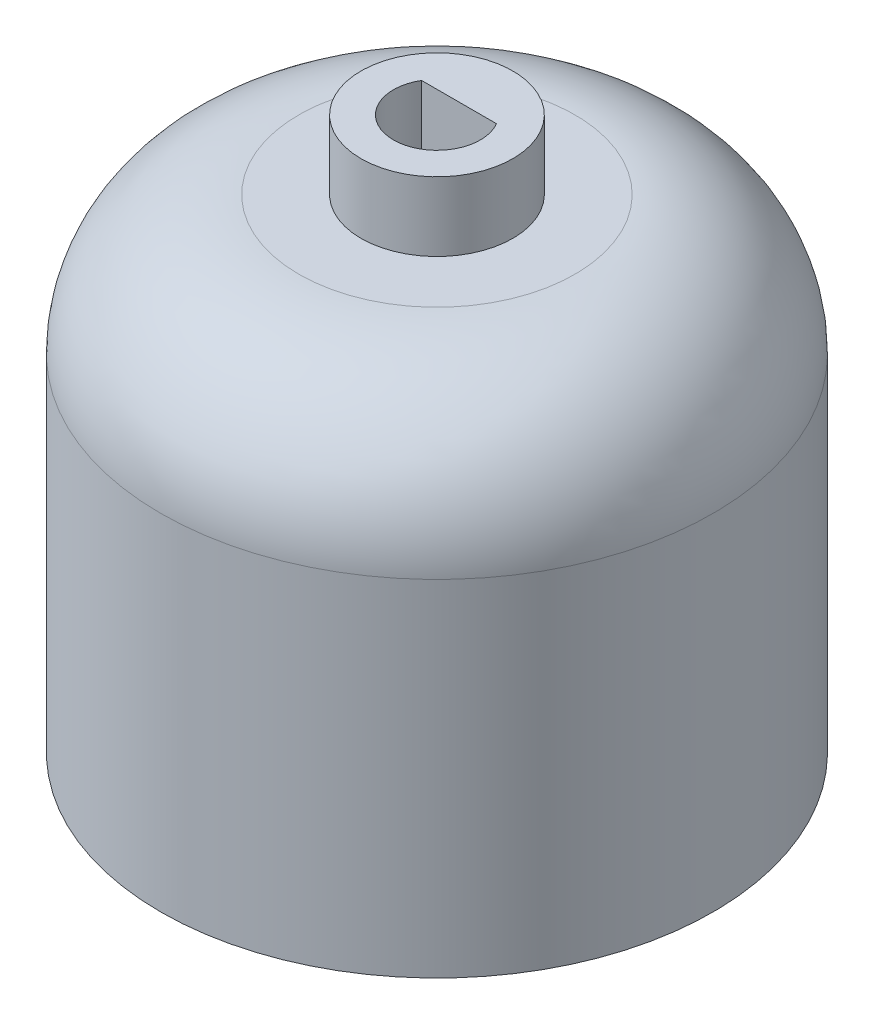
ISO-10303-21;
HEADER;
FILE_DESCRIPTION(('STEP AP214'),'2;1');
FILE_NAME('part.step','',(''),(''),'','','');
FILE_SCHEMA(('AUTOMOTIVE_DESIGN { 1 0 10303 214 1 1 1 1 }'));
ENDSEC;
DATA;
#1=APPLICATION_CONTEXT('core data for automotive mechanical design processes');
#2=APPLICATION_PROTOCOL_DEFINITION('international standard','automotive_design',2000,#1);
#3=PRODUCT_CONTEXT('',#1,'mechanical');
#4=PRODUCT('Part','Part','',(#3));
#5=PRODUCT_RELATED_PRODUCT_CATEGORY('part','',(#4));
#6=PRODUCT_DEFINITION_FORMATION('','',#4);
#7=PRODUCT_DEFINITION_CONTEXT('part definition',#1,'design');
#8=PRODUCT_DEFINITION('design','',#6,#7);
#9=PRODUCT_DEFINITION_SHAPE('','',#8);
#10=(LENGTH_UNIT() NAMED_UNIT(*) SI_UNIT(.MILLI.,.METRE.));
#11=(NAMED_UNIT(*) PLANE_ANGLE_UNIT() SI_UNIT($,.RADIAN.));
#12=(NAMED_UNIT(*) SI_UNIT($,.STERADIAN.) SOLID_ANGLE_UNIT());
#13=UNCERTAINTY_MEASURE_WITH_UNIT(LENGTH_MEASURE(1.E-05),#10,'distance_accuracy_value','');
#14=(GEOMETRIC_REPRESENTATION_CONTEXT(3) GLOBAL_UNCERTAINTY_ASSIGNED_CONTEXT((#13)) GLOBAL_UNIT_ASSIGNED_CONTEXT((#10,
#11,#12)) REPRESENTATION_CONTEXT('',''));
#15=CARTESIAN_POINT('',(0.,0.,0.));
#16=DIRECTION('',(0.,0.,1.));
#17=DIRECTION('',(1.,0.,0.));
#18=AXIS2_PLACEMENT_3D('',#15,#16,#17);
#19=CARTESIAN_POINT('',(0.,35.,0.));
#20=DIRECTION('',(0.,1.,0.));
#21=DIRECTION('',(0.,0.,1.));
#22=AXIS2_PLACEMENT_3D('',#19,#20,#21);
#23=PLANE('',#22);
#24=CARTESIAN_POINT('',(0.,35.,0.));
#25=DIRECTION('',(0.,1.,0.));
#26=DIRECTION('',(0.,0.,1.));
#27=AXIS2_PLACEMENT_3D('',#24,#25,#26);
#28=CIRCLE('',#27,10.);
#29=CARTESIAN_POINT('',(0.,35.,10.));
#30=VERTEX_POINT('',#29);
#31=EDGE_CURVE('E41',#30,#30,#28,.T.);
#32=ORIENTED_EDGE('',*,*,#31,.T.);
#33=EDGE_LOOP('',(#32));
#34=FACE_BOUND('',#33,.T.);
#35=CARTESIAN_POINT('',(0.,35.,0.));
#36=DIRECTION('',(0.,1.,0.));
#37=DIRECTION('',(0.,0.,1.));
#38=AXIS2_PLACEMENT_3D('',#35,#36,#37);
#39=CIRCLE('',#38,5.5);
#40=CARTESIAN_POINT('',(0.,35.,5.5));
#41=VERTEX_POINT('',#40);
#42=EDGE_CURVE('E109',#41,#41,#39,.T.);
#43=ORIENTED_EDGE('',*,*,#42,.F.);
#44=EDGE_LOOP('',(#43));
#45=FACE_BOUND('',#44,.T.);
#46=ADVANCED_FACE('F33',(#34,#45),#23,.T.);
#47=CARTESIAN_POINT('',(0.,0.,0.));
#48=DIRECTION('',(0.,1.,0.));
#49=DIRECTION('',(0.,0.,1.));
#50=AXIS2_PLACEMENT_3D('',#47,#48,#49);
#51=PLANE('',#50);
#52=CARTESIAN_POINT('',(0.,0.,0.));
#53=DIRECTION('',(0.,1.,0.));
#54=DIRECTION('',(0.,0.,1.));
#55=AXIS2_PLACEMENT_3D('',#52,#53,#54);
#56=CIRCLE('',#55,20.);
#57=CARTESIAN_POINT('',(0.,0.,20.));
#58=VERTEX_POINT('',#57);
#59=EDGE_CURVE('E145',#58,#58,#56,.T.);
#60=ORIENTED_EDGE('',*,*,#59,.F.);
#61=EDGE_LOOP('',(#60));
#62=FACE_BOUND('',#61,.T.);
#63=DIRECTION('',(0.,0.,1.));
#64=VECTOR('',#63,1.);
#65=CARTESIAN_POINT('',(-4.4,0.,-17.6));
#66=LINE('',#65,#64);
#67=CARTESIAN_POINT('',(-4.4,0.,-17.6));
#68=VERTEX_POINT('',#67);
#69=CARTESIAN_POINT('',(-4.4,0.,-12.0732141536544));
#70=VERTEX_POINT('',#69);
#71=EDGE_CURVE('E55',#68,#70,#66,.T.);
#72=ORIENTED_EDGE('',*,*,#71,.T.);
#73=CARTESIAN_POINT('',(0.,0.,0.));
#74=DIRECTION('',(0.,1.,0.));
#75=DIRECTION('',(0.,0.,1.));
#76=AXIS2_PLACEMENT_3D('',#73,#74,#75);
#77=CIRCLE('',#76,12.85);
#78=CARTESIAN_POINT('',(4.4,0.,-12.0732141536544));
#79=VERTEX_POINT('',#78);
#80=EDGE_CURVE('E130',#70,#79,#77,.T.);
#81=ORIENTED_EDGE('',*,*,#80,.T.);
#82=DIRECTION('',(0.,0.,-1.));
#83=VECTOR('',#82,1.);
#84=CARTESIAN_POINT('',(4.4,0.,-17.6));
#85=LINE('',#84,#83);
#86=CARTESIAN_POINT('',(4.4,0.,-17.6));
#87=VERTEX_POINT('',#86);
#88=EDGE_CURVE('E133',#79,#87,#85,.T.);
#89=ORIENTED_EDGE('',*,*,#88,.T.);
#90=DIRECTION('',(-1.,0.,0.));
#91=VECTOR('',#90,1.);
#92=CARTESIAN_POINT('',(-4.4,0.,-17.6));
#93=LINE('',#92,#91);
#94=EDGE_CURVE('E119',#87,#68,#93,.T.);
#95=ORIENTED_EDGE('',*,*,#94,.T.);
#96=EDGE_LOOP('',(#72,#81,#89,#95));
#97=FACE_BOUND('',#96,.T.);
#98=ADVANCED_FACE('F161',(#62,#97),#51,.F.);
#99=CARTESIAN_POINT('',(0.,30.,0.));
#100=DIRECTION('',(0.,-1.,0.));
#101=DIRECTION('',(0.,0.,-1.));
#102=AXIS2_PLACEMENT_3D('',#99,#100,#101);
#103=CYLINDRICAL_SURFACE('',#102,20.);
#104=CARTESIAN_POINT('',(0.,25.,0.));
#105=DIRECTION('',(0.,1.,0.));
#106=DIRECTION('',(0.,0.,1.));
#107=AXIS2_PLACEMENT_3D('',#104,#105,#106);
#108=CIRCLE('',#107,20.);
#109=CARTESIAN_POINT('',(0.,25.,20.));
#110=VERTEX_POINT('',#109);
#111=EDGE_CURVE('E11',#110,#110,#108,.F.);
#112=ORIENTED_EDGE('',*,*,#111,.T.);
#113=EDGE_LOOP('',(#112));
#114=FACE_BOUND('',#113,.T.);
#115=ORIENTED_EDGE('',*,*,#59,.T.);
#116=EDGE_LOOP('',(#115));
#117=FACE_BOUND('',#116,.T.);
#118=ADVANCED_FACE('F165',(#114,#117),#103,.T.);
#119=CARTESIAN_POINT('',(-4.4,30.,-17.6));
#120=DIRECTION('',(1.,0.,0.));
#121=DIRECTION('',(0.,0.,-1.));
#122=AXIS2_PLACEMENT_3D('',#119,#120,#121);
#123=PLANE('',#122);
#124=ORIENTED_EDGE('',*,*,#71,.F.);
#125=DIRECTION('',(0.,-1.,0.));
#126=VECTOR('',#125,1.);
#127=CARTESIAN_POINT('',(-4.4,30.,-17.6));
#128=LINE('',#127,#126);
#129=CARTESIAN_POINT('',(-4.4,30.,-17.6));
#130=VERTEX_POINT('',#129);
#131=EDGE_CURVE('E128',#130,#68,#128,.T.);
#132=ORIENTED_EDGE('',*,*,#131,.F.);
#133=DIRECTION('',(0.,0.,1.));
#134=VECTOR('',#133,1.);
#135=CARTESIAN_POINT('',(-4.4,30.,-17.6));
#136=LINE('',#135,#134);
#137=CARTESIAN_POINT('',(-4.4,30.,-12.0732141536544));
#138=VERTEX_POINT('',#137);
#139=EDGE_CURVE('E115',#130,#138,#136,.T.);
#140=ORIENTED_EDGE('',*,*,#139,.T.);
#141=DIRECTION('',(0.,-1.,0.));
#142=VECTOR('',#141,1.);
#143=CARTESIAN_POINT('',(-4.4,30.,-12.0732141536544));
#144=LINE('',#143,#142);
#145=EDGE_CURVE('E143',#138,#70,#144,.T.);
#146=ORIENTED_EDGE('',*,*,#145,.T.);
#147=EDGE_LOOP('',(#124,#132,#140,#146));
#148=FACE_BOUND('',#147,.T.);
#149=ADVANCED_FACE('F187',(#148),#123,.T.);
#150=CARTESIAN_POINT('',(0.,30.,0.));
#151=DIRECTION('',(0.,-1.,0.));
#152=DIRECTION('',(0.,0.,-1.));
#153=AXIS2_PLACEMENT_3D('',#150,#151,#152);
#154=CYLINDRICAL_SURFACE('',#153,12.85);
#155=ORIENTED_EDGE('',*,*,#80,.F.);
#156=ORIENTED_EDGE('',*,*,#145,.F.);
#157=CARTESIAN_POINT('',(0.,30.,0.));
#158=DIRECTION('',(0.,1.,0.));
#159=DIRECTION('',(0.,0.,1.));
#160=AXIS2_PLACEMENT_3D('',#157,#158,#159);
#161=CIRCLE('',#160,12.85);
#162=CARTESIAN_POINT('',(4.4,30.,-12.0732141536544));
#163=VERTEX_POINT('',#162);
#164=EDGE_CURVE('E118',#138,#163,#161,.T.);
#165=ORIENTED_EDGE('',*,*,#164,.T.);
#166=DIRECTION('',(0.,-1.,0.));
#167=VECTOR('',#166,1.);
#168=CARTESIAN_POINT('',(4.4,30.,-12.0732141536544));
#169=LINE('',#168,#167);
#170=EDGE_CURVE('E141',#163,#79,#169,.T.);
#171=ORIENTED_EDGE('',*,*,#170,.T.);
#172=EDGE_LOOP('',(#155,#156,#165,#171));
#173=FACE_BOUND('',#172,.T.);
#174=ADVANCED_FACE('F183',(#173),#154,.F.);
#175=CARTESIAN_POINT('',(4.4,30.,-17.6));
#176=DIRECTION('',(-1.,0.,0.));
#177=DIRECTION('',(0.,0.,1.));
#178=AXIS2_PLACEMENT_3D('',#175,#176,#177);
#179=PLANE('',#178);
#180=ORIENTED_EDGE('',*,*,#88,.F.);
#181=ORIENTED_EDGE('',*,*,#170,.F.);
#182=DIRECTION('',(0.,0.,-1.));
#183=VECTOR('',#182,1.);
#184=CARTESIAN_POINT('',(4.4,30.,-17.6));
#185=LINE('',#184,#183);
#186=CARTESIAN_POINT('',(4.4,30.,-17.6));
#187=VERTEX_POINT('',#186);
#188=EDGE_CURVE('E122',#163,#187,#185,.T.);
#189=ORIENTED_EDGE('',*,*,#188,.T.);
#190=DIRECTION('',(0.,-1.,0.));
#191=VECTOR('',#190,1.);
#192=CARTESIAN_POINT('',(4.4,30.,-17.6));
#193=LINE('',#192,#191);
#194=EDGE_CURVE('E139',#187,#87,#193,.T.);
#195=ORIENTED_EDGE('',*,*,#194,.T.);
#196=EDGE_LOOP('',(#180,#181,#189,#195));
#197=FACE_BOUND('',#196,.T.);
#198=ADVANCED_FACE('F179',(#197),#179,.T.);
#199=CARTESIAN_POINT('',(-4.4,30.,-17.6));
#200=DIRECTION('',(0.,0.,1.));
#201=DIRECTION('',(1.,0.,0.));
#202=AXIS2_PLACEMENT_3D('',#199,#200,#201);
#203=PLANE('',#202);
#204=ORIENTED_EDGE('',*,*,#94,.F.);
#205=ORIENTED_EDGE('',*,*,#194,.F.);
#206=DIRECTION('',(-1.,0.,0.));
#207=VECTOR('',#206,1.);
#208=CARTESIAN_POINT('',(-4.4,30.,-17.6));
#209=LINE('',#208,#207);
#210=EDGE_CURVE('E125',#187,#130,#209,.T.);
#211=ORIENTED_EDGE('',*,*,#210,.T.);
#212=ORIENTED_EDGE('',*,*,#131,.T.);
#213=EDGE_LOOP('',(#204,#205,#211,#212));
#214=FACE_BOUND('',#213,.T.);
#215=ADVANCED_FACE('F175',(#214),#203,.T.);
#216=CARTESIAN_POINT('',(0.,30.,0.));
#217=DIRECTION('',(0.,1.,0.));
#218=DIRECTION('',(0.,0.,1.));
#219=AXIS2_PLACEMENT_3D('',#216,#217,#218);
#220=PLANE('',#219);
#221=ORIENTED_EDGE('',*,*,#139,.F.);
#222=ORIENTED_EDGE('',*,*,#210,.F.);
#223=ORIENTED_EDGE('',*,*,#188,.F.);
#224=ORIENTED_EDGE('',*,*,#164,.F.);
#225=EDGE_LOOP('',(#221,#222,#223,#224));
#226=FACE_BOUND('',#225,.T.);
#227=ADVANCED_FACE('F172',(#226),#220,.F.);
#228=CARTESIAN_POINT('',(0.,40.,0.));
#229=DIRECTION('',(0.,1.,0.));
#230=DIRECTION('',(0.,0.,1.));
#231=AXIS2_PLACEMENT_3D('',#228,#229,#230);
#232=PLANE('',#231);
#233=CARTESIAN_POINT('',(0.,40.,0.));
#234=DIRECTION('',(0.,1.,0.));
#235=DIRECTION('',(0.,0.,1.));
#236=AXIS2_PLACEMENT_3D('',#233,#234,#235);
#237=CIRCLE('',#236,5.5);
#238=CARTESIAN_POINT('',(0.,40.,5.5));
#239=VERTEX_POINT('',#238);
#240=EDGE_CURVE('E110',#239,#239,#237,.T.);
#241=ORIENTED_EDGE('',*,*,#240,.T.);
#242=EDGE_LOOP('',(#241));
#243=FACE_BOUND('',#242,.T.);
#244=DIRECTION('',(-1.,0.,0.));
#245=VECTOR('',#244,1.);
#246=CARTESIAN_POINT('',(-2.71339271024303,40.,-1.6));
#247=LINE('',#246,#245);
#248=CARTESIAN_POINT('',(2.71339271024303,40.,-1.6));
#249=VERTEX_POINT('',#248);
#250=CARTESIAN_POINT('',(-2.71339271024303,40.,-1.6));
#251=VERTEX_POINT('',#250);
#252=EDGE_CURVE('E88',#249,#251,#247,.T.);
#253=ORIENTED_EDGE('',*,*,#252,.F.);
#254=CARTESIAN_POINT('',(0.,40.,0.));
#255=DIRECTION('',(0.,1.,0.));
#256=DIRECTION('',(0.,0.,1.));
#257=AXIS2_PLACEMENT_3D('',#254,#255,#256);
#258=CIRCLE('',#257,3.15);
#259=EDGE_CURVE('E97',#251,#249,#258,.T.);
#260=ORIENTED_EDGE('',*,*,#259,.F.);
#261=EDGE_LOOP('',(#253,#260));
#262=FACE_BOUND('',#261,.T.);
#263=ADVANCED_FACE('F103',(#243,#262),#232,.T.);
#264=CARTESIAN_POINT('',(0.,40.,0.));
#265=DIRECTION('',(0.,-1.,0.));
#266=DIRECTION('',(0.,0.,-1.));
#267=AXIS2_PLACEMENT_3D('',#264,#265,#266);
#268=CYLINDRICAL_SURFACE('',#267,5.5);
#269=ORIENTED_EDGE('',*,*,#240,.F.);
#270=EDGE_LOOP('',(#269));
#271=FACE_BOUND('',#270,.T.);
#272=ORIENTED_EDGE('',*,*,#42,.T.);
#273=EDGE_LOOP('',(#272));
#274=FACE_BOUND('',#273,.T.);
#275=ADVANCED_FACE('F170',(#271,#274),#268,.T.);
#276=CARTESIAN_POINT('',(0.,40.,0.));
#277=DIRECTION('',(0.,-1.,0.));
#278=DIRECTION('',(0.,0.,-1.));
#279=AXIS2_PLACEMENT_3D('',#276,#277,#278);
#280=CYLINDRICAL_SURFACE('',#279,3.15);
#281=CARTESIAN_POINT('',(0.,35.,0.));
#282=DIRECTION('',(0.,1.,0.));
#283=DIRECTION('',(0.,0.,1.));
#284=AXIS2_PLACEMENT_3D('',#281,#282,#283);
#285=CIRCLE('',#284,3.15);
#286=CARTESIAN_POINT('',(-2.71339271024303,35.,-1.6));
#287=VERTEX_POINT('',#286);
#288=CARTESIAN_POINT('',(2.71339271024303,35.,-1.6));
#289=VERTEX_POINT('',#288);
#290=EDGE_CURVE('E101',#287,#289,#285,.T.);
#291=ORIENTED_EDGE('',*,*,#290,.F.);
#292=DIRECTION('',(0.,-1.,0.));
#293=VECTOR('',#292,1.);
#294=CARTESIAN_POINT('',(-2.71339271024303,40.,-1.6));
#295=LINE('',#294,#293);
#296=EDGE_CURVE('E91',#251,#287,#295,.T.);
#297=ORIENTED_EDGE('',*,*,#296,.F.);
#298=ORIENTED_EDGE('',*,*,#259,.T.);
#299=DIRECTION('',(0.,-1.,0.));
#300=VECTOR('',#299,1.);
#301=CARTESIAN_POINT('',(2.71339271024303,40.,-1.6));
#302=LINE('',#301,#300);
#303=EDGE_CURVE('E93',#249,#289,#302,.T.);
#304=ORIENTED_EDGE('',*,*,#303,.T.);
#305=EDGE_LOOP('',(#291,#297,#298,#304));
#306=FACE_BOUND('',#305,.T.);
#307=ADVANCED_FACE('F100',(#306),#280,.F.);
#308=CARTESIAN_POINT('',(-2.71339271024303,40.,-1.6));
#309=DIRECTION('',(0.,0.,1.));
#310=DIRECTION('',(1.,0.,0.));
#311=AXIS2_PLACEMENT_3D('',#308,#309,#310);
#312=PLANE('',#311);
#313=DIRECTION('',(-1.,0.,0.));
#314=VECTOR('',#313,1.);
#315=CARTESIAN_POINT('',(-2.71339271024303,35.,-1.6));
#316=LINE('',#315,#314);
#317=EDGE_CURVE('E47',#289,#287,#316,.T.);
#318=ORIENTED_EDGE('',*,*,#317,.F.);
#319=ORIENTED_EDGE('',*,*,#303,.F.);
#320=ORIENTED_EDGE('',*,*,#252,.T.);
#321=ORIENTED_EDGE('',*,*,#296,.T.);
#322=EDGE_LOOP('',(#318,#319,#320,#321));
#323=FACE_BOUND('',#322,.T.);
#324=ADVANCED_FACE('F90',(#323),#312,.T.);
#325=ORIENTED_EDGE('',*,*,#290,.T.);
#326=ORIENTED_EDGE('',*,*,#317,.T.);
#327=EDGE_LOOP('',(#325,#326));
#328=FACE_BOUND('',#327,.T.);
#329=ADVANCED_FACE('F153',(#328),#23,.T.);
#330=CARTESIAN_POINT('',(0.,25.,0.));
#331=DIRECTION('',(0.,1.,0.));
#332=DIRECTION('',(0.,0.,1.));
#333=AXIS2_PLACEMENT_3D('',#330,#331,#332);
#334=DEGENERATE_TOROIDAL_SURFACE('',#333,10.,10.,.T.);
#335=ORIENTED_EDGE('',*,*,#111,.F.);
#336=EDGE_LOOP('',(#335));
#337=FACE_BOUND('',#336,.T.);
#338=ORIENTED_EDGE('',*,*,#31,.F.);
#339=EDGE_LOOP('',(#338));
#340=FACE_BOUND('',#339,.T.);
#341=ADVANCED_FACE('F35',(#337,#340),#334,.T.);
#342=CLOSED_SHELL('',(#46,#98,#118,#149,#174,#198,#215,#227,#263,#275,#307,#324,#329,#341));
#343=MANIFOLD_SOLID_BREP('B2',#342);
#344=ADVANCED_BREP_SHAPE_REPRESENTATION('',(#18,#343),#14);
#345=SHAPE_DEFINITION_REPRESENTATION(#9,#344);
ENDSEC;
END-ISO-10303-21;
